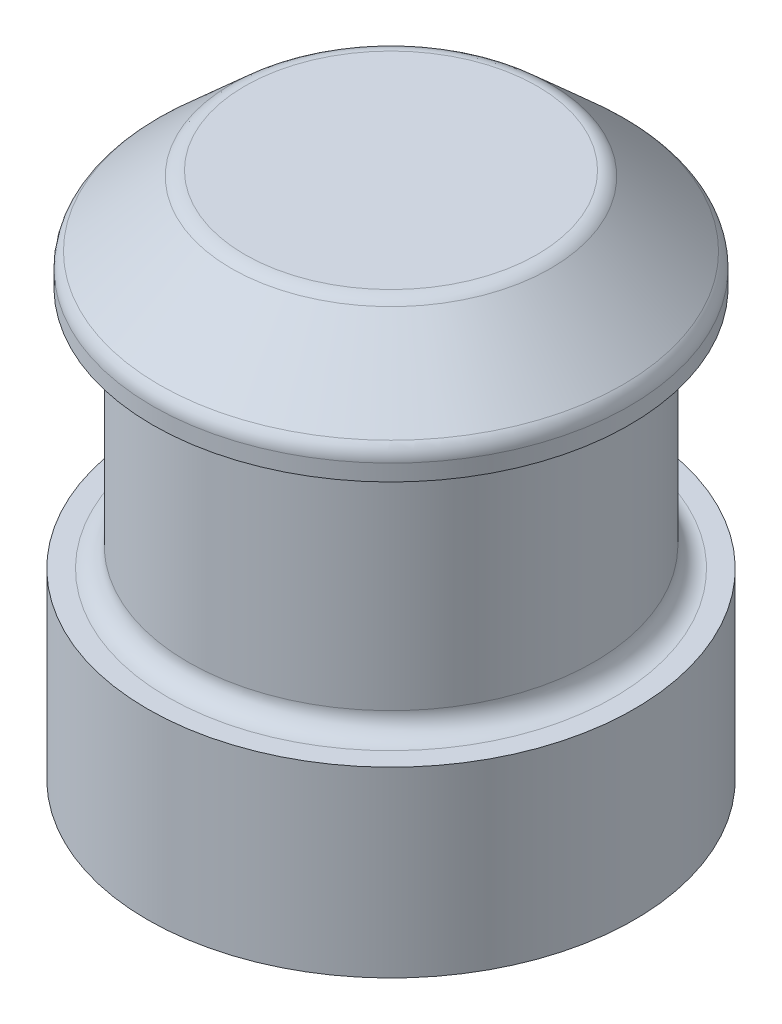
ISO-10303-21;
HEADER;
FILE_DESCRIPTION(('STEP AP214'),'2;1');
FILE_NAME('part.step','',(''),(''),'','','');
FILE_SCHEMA(('AUTOMOTIVE_DESIGN { 1 0 10303 214 1 1 1 1 }'));
ENDSEC;
DATA;
#1=APPLICATION_CONTEXT('core data for automotive mechanical design processes');
#2=APPLICATION_PROTOCOL_DEFINITION('international standard','automotive_design',2000,#1);
#3=PRODUCT_CONTEXT('',#1,'mechanical');
#4=PRODUCT('Part','Part','',(#3));
#5=PRODUCT_RELATED_PRODUCT_CATEGORY('part','',(#4));
#6=PRODUCT_DEFINITION_FORMATION('','',#4);
#7=PRODUCT_DEFINITION_CONTEXT('part definition',#1,'design');
#8=PRODUCT_DEFINITION('design','',#6,#7);
#9=PRODUCT_DEFINITION_SHAPE('','',#8);
#10=(LENGTH_UNIT() NAMED_UNIT(*) SI_UNIT(.MILLI.,.METRE.));
#11=(NAMED_UNIT(*) PLANE_ANGLE_UNIT() SI_UNIT($,.RADIAN.));
#12=(NAMED_UNIT(*) SI_UNIT($,.STERADIAN.) SOLID_ANGLE_UNIT());
#13=UNCERTAINTY_MEASURE_WITH_UNIT(LENGTH_MEASURE(1.E-05),#10,'distance_accuracy_value','');
#14=(GEOMETRIC_REPRESENTATION_CONTEXT(3) GLOBAL_UNCERTAINTY_ASSIGNED_CONTEXT((#13)) GLOBAL_UNIT_ASSIGNED_CONTEXT((#10,
#11,#12)) REPRESENTATION_CONTEXT('',''));
#15=CARTESIAN_POINT('',(0.,0.,0.));
#16=DIRECTION('',(0.,0.,1.));
#17=DIRECTION('',(1.,0.,0.));
#18=AXIS2_PLACEMENT_3D('',#15,#16,#17);
#19=CARTESIAN_POINT('',(0.,1.7125769521578,0.));
#20=DIRECTION('',(0.,-1.,0.));
#21=DIRECTION('',(0.,0.,-1.));
#22=AXIS2_PLACEMENT_3D('',#19,#20,#21);
#23=CYLINDRICAL_SURFACE('',#22,2.76);
#24=CARTESIAN_POINT('',(0.,1.7125769521578,0.));
#25=DIRECTION('',(0.,1.,0.));
#26=DIRECTION('',(0.,0.,1.));
#27=AXIS2_PLACEMENT_3D('',#24,#25,#26);
#28=CIRCLE('',#27,2.76);
#29=CARTESIAN_POINT('',(0.,1.7125769521578,2.76));
#30=VERTEX_POINT('',#29);
#31=EDGE_CURVE('E58',#30,#30,#28,.T.);
#32=ORIENTED_EDGE('',*,*,#31,.F.);
#33=EDGE_LOOP('',(#32));
#34=FACE_BOUND('',#33,.T.);
#35=CARTESIAN_POINT('',(0.,-0.357423047842197,0.));
#36=DIRECTION('',(0.,1.,0.));
#37=DIRECTION('',(0.,0.,1.));
#38=AXIS2_PLACEMENT_3D('',#35,#36,#37);
#39=CIRCLE('',#38,2.76);
#40=CARTESIAN_POINT('',(0.,-0.357423047842197,2.76));
#41=VERTEX_POINT('',#40);
#42=EDGE_CURVE('E59',#41,#41,#39,.T.);
#43=ORIENTED_EDGE('',*,*,#42,.T.);
#44=EDGE_LOOP('',(#43));
#45=FACE_BOUND('',#44,.T.);
#46=ADVANCED_FACE('F32',(#34,#45),#23,.T.);
#47=CARTESIAN_POINT('',(0.,1.7125769521578,0.));
#48=DIRECTION('',(0.,1.,0.));
#49=DIRECTION('',(0.,0.,1.));
#50=AXIS2_PLACEMENT_3D('',#47,#48,#49);
#51=PLANE('',#50);
#52=CARTESIAN_POINT('',(0.,1.7125769521578,0.));
#53=DIRECTION('',(0.,1.,0.));
#54=DIRECTION('',(0.,0.,1.));
#55=AXIS2_PLACEMENT_3D('',#52,#53,#54);
#56=CIRCLE('',#55,2.53);
#57=CARTESIAN_POINT('',(0.,1.7125769521578,2.53));
#58=VERTEX_POINT('',#57);
#59=EDGE_CURVE('E10',#58,#58,#56,.F.);
#60=ORIENTED_EDGE('',*,*,#59,.T.);
#61=EDGE_LOOP('',(#60));
#62=FACE_BOUND('',#61,.T.);
#63=ORIENTED_EDGE('',*,*,#31,.T.);
#64=EDGE_LOOP('',(#63));
#65=FACE_BOUND('',#64,.T.);
#66=ADVANCED_FACE('F90',(#62,#65),#51,.T.);
#67=CARTESIAN_POINT('',(0.,-0.357423047842197,0.));
#68=DIRECTION('',(0.,1.,0.));
#69=DIRECTION('',(0.,0.,1.));
#70=AXIS2_PLACEMENT_3D('',#67,#68,#69);
#71=PLANE('',#70);
#72=ORIENTED_EDGE('',*,*,#42,.F.);
#73=EDGE_LOOP('',(#72));
#74=FACE_BOUND('',#73,.T.);
#75=ADVANCED_FACE('F96',(#74),#71,.F.);
#76=CARTESIAN_POINT('',(0.,4.4725769521578,0.));
#77=DIRECTION('',(0.,-1.,0.));
#78=DIRECTION('',(0.,0.,-1.));
#79=AXIS2_PLACEMENT_3D('',#76,#77,#78);
#80=CYLINDRICAL_SURFACE('',#79,2.3);
#81=CARTESIAN_POINT('',(0.,1.9425769521578,0.));
#82=DIRECTION('',(0.,1.,0.));
#83=DIRECTION('',(0.,0.,1.));
#84=AXIS2_PLACEMENT_3D('',#81,#82,#83);
#85=CIRCLE('',#84,2.3);
#86=CARTESIAN_POINT('',(0.,1.9425769521578,2.3));
#87=VERTEX_POINT('',#86);
#88=EDGE_CURVE('E39',#87,#87,#85,.T.);
#89=ORIENTED_EDGE('',*,*,#88,.T.);
#90=EDGE_LOOP('',(#89));
#91=FACE_BOUND('',#90,.T.);
#92=CARTESIAN_POINT('',(0.,4.4725769521578,0.));
#93=DIRECTION('',(0.,1.,0.));
#94=DIRECTION('',(0.,0.,1.));
#95=AXIS2_PLACEMENT_3D('',#92,#93,#94);
#96=CIRCLE('',#95,2.3);
#97=CARTESIAN_POINT('',(0.,4.4725769521578,2.3));
#98=VERTEX_POINT('',#97);
#99=EDGE_CURVE('E62',#98,#98,#96,.T.);
#100=ORIENTED_EDGE('',*,*,#99,.F.);
#101=EDGE_LOOP('',(#100));
#102=FACE_BOUND('',#101,.T.);
#103=ADVANCED_FACE('F116',(#91,#102),#80,.T.);
#104=CARTESIAN_POINT('',(0.,5.6225769521578,0.));
#105=DIRECTION('',(0.,-1.,0.));
#106=DIRECTION('',(0.,0.,-1.));
#107=AXIS2_PLACEMENT_3D('',#104,#105,#106);
#108=CYLINDRICAL_SURFACE('',#107,2.7025);
#109=CARTESIAN_POINT('',(0.,4.65767435453684,0.));
#110=DIRECTION('',(0.,1.,0.));
#111=DIRECTION('',(0.,0.,1.));
#112=AXIS2_PLACEMENT_3D('',#109,#110,#111);
#113=CIRCLE('',#112,2.7025);
#114=CARTESIAN_POINT('',(0.,4.65767435453684,2.7025));
#115=VERTEX_POINT('',#114);
#116=EDGE_CURVE('E43',#115,#115,#113,.F.);
#117=ORIENTED_EDGE('',*,*,#116,.T.);
#118=EDGE_LOOP('',(#117));
#119=FACE_BOUND('',#118,.T.);
#120=CARTESIAN_POINT('',(0.,4.4725769521578,0.));
#121=DIRECTION('',(0.,1.,0.));
#122=DIRECTION('',(0.,0.,1.));
#123=AXIS2_PLACEMENT_3D('',#120,#121,#122);
#124=CIRCLE('',#123,2.7025);
#125=CARTESIAN_POINT('',(0.,4.4725769521578,2.7025));
#126=VERTEX_POINT('',#125);
#127=EDGE_CURVE('E67',#126,#126,#124,.T.);
#128=ORIENTED_EDGE('',*,*,#127,.T.);
#129=EDGE_LOOP('',(#128));
#130=FACE_BOUND('',#129,.T.);
#131=ADVANCED_FACE('F71',(#119,#130),#108,.T.);
#132=CARTESIAN_POINT('',(0.,5.6225769521578,0.));
#133=DIRECTION('',(0.,1.,0.));
#134=DIRECTION('',(0.,0.,1.));
#135=AXIS2_PLACEMENT_3D('',#132,#133,#134);
#136=PLANE('',#135);
#137=CARTESIAN_POINT('',(0.,5.6225769521578,0.));
#138=DIRECTION('',(0.,1.,0.));
#139=DIRECTION('',(0.,0.,1.));
#140=AXIS2_PLACEMENT_3D('',#137,#138,#139);
#141=CIRCLE('',#140,1.65630797790168);
#142=CARTESIAN_POINT('',(0.,5.6225769521578,1.65630797790168));
#143=VERTEX_POINT('',#142);
#144=EDGE_CURVE('E55',#143,#143,#141,.T.);
#145=ORIENTED_EDGE('',*,*,#144,.T.);
#146=EDGE_LOOP('',(#145));
#147=FACE_BOUND('',#146,.T.);
#148=ADVANCED_FACE('F76',(#147),#136,.T.);
#149=CARTESIAN_POINT('',(0.,4.4725769521578,0.));
#150=DIRECTION('',(0.,1.,0.));
#151=DIRECTION('',(0.,0.,1.));
#152=AXIS2_PLACEMENT_3D('',#149,#150,#151);
#153=PLANE('',#152);
#154=ORIENTED_EDGE('',*,*,#99,.T.);
#155=EDGE_LOOP('',(#154));
#156=FACE_BOUND('',#155,.T.);
#157=ORIENTED_EDGE('',*,*,#127,.F.);
#158=EDGE_LOOP('',(#157));
#159=FACE_BOUND('',#158,.T.);
#160=ADVANCED_FACE('F73',(#156,#159),#153,.F.);
#161=CARTESIAN_POINT('',(0.,5.6225769521578,0.));
#162=DIRECTION('',(0.,-1.,0.));
#163=DIRECTION('',(0.,0.,-1.));
#164=AXIS2_PLACEMENT_3D('',#161,#162,#163);
#165=CONICAL_SURFACE('',#164,1.74459670595982,0.837758040957275);
#166=CARTESIAN_POINT('',(0.,5.5635002620176,0.));
#167=DIRECTION('',(0.,1.,0.));
#168=DIRECTION('',(0.,0.,1.));
#169=AXIS2_PLACEMENT_3D('',#166,#167,#168);
#170=CIRCLE('',#169,1.81020801736421);
#171=CARTESIAN_POINT('',(0.,5.5635002620176,1.81020801736421));
#172=VERTEX_POINT('',#171);
#173=EDGE_CURVE('E47',#172,#172,#170,.F.);
#174=ORIENTED_EDGE('',*,*,#173,.T.);
#175=EDGE_LOOP('',(#174));
#176=FACE_BOUND('',#175,.T.);
#177=CARTESIAN_POINT('',(0.,4.82859766439664,0.));
#178=DIRECTION('',(0.,-1.,0.));
#179=DIRECTION('',(0.,0.,-1.));
#180=AXIS2_PLACEMENT_3D('',#177,#178,#179);
#181=CIRCLE('',#180,2.62640003946254);
#182=CARTESIAN_POINT('',(0.,4.82859766439664,-2.62640003946254));
#183=VERTEX_POINT('',#182);
#184=EDGE_CURVE('E52',#183,#183,#181,.F.);
#185=ORIENTED_EDGE('',*,*,#184,.T.);
#186=EDGE_LOOP('',(#185));
#187=FACE_BOUND('',#186,.T.);
#188=ADVANCED_FACE('F75',(#176,#187),#165,.T.);
#189=CARTESIAN_POINT('',(0.,5.3925769521578,0.));
#190=DIRECTION('',(0.,1.,0.));
#191=DIRECTION('',(0.,0.,1.));
#192=AXIS2_PLACEMENT_3D('',#189,#190,#191);
#193=TOROIDAL_SURFACE('',#192,1.65630797790168,0.23);
#194=ORIENTED_EDGE('',*,*,#173,.F.);
#195=EDGE_LOOP('',(#194));
#196=FACE_BOUND('',#195,.T.);
#197=ORIENTED_EDGE('',*,*,#144,.F.);
#198=EDGE_LOOP('',(#197));
#199=FACE_BOUND('',#198,.T.);
#200=ADVANCED_FACE('F83',(#196,#199),#193,.T.);
#201=CARTESIAN_POINT('',(0.,4.65767435453684,0.));
#202=DIRECTION('',(0.,1.,0.));
#203=DIRECTION('',(0.,0.,1.));
#204=AXIS2_PLACEMENT_3D('',#201,#202,#203);
#205=TOROIDAL_SURFACE('',#204,2.4725,0.23);
#206=ORIENTED_EDGE('',*,*,#184,.F.);
#207=EDGE_LOOP('',(#206));
#208=FACE_BOUND('',#207,.T.);
#209=ORIENTED_EDGE('',*,*,#116,.F.);
#210=EDGE_LOOP('',(#209));
#211=FACE_BOUND('',#210,.T.);
#212=ADVANCED_FACE('F103',(#208,#211),#205,.T.);
#213=CARTESIAN_POINT('',(0.,1.9425769521578,0.));
#214=DIRECTION('',(0.,1.,0.));
#215=DIRECTION('',(0.,0.,1.));
#216=AXIS2_PLACEMENT_3D('',#213,#214,#215);
#217=TOROIDAL_SURFACE('',#216,2.53,0.23);
#218=ORIENTED_EDGE('',*,*,#59,.F.);
#219=EDGE_LOOP('',(#218));
#220=FACE_BOUND('',#219,.T.);
#221=ORIENTED_EDGE('',*,*,#88,.F.);
#222=EDGE_LOOP('',(#221));
#223=FACE_BOUND('',#222,.T.);
#224=ADVANCED_FACE('F34',(#220,#223),#217,.F.);
#225=CLOSED_SHELL('',(#46,#66,#75,#103,#131,#148,#160,#188,#200,#212,#224));
#226=MANIFOLD_SOLID_BREP('B2',#225);
#227=ADVANCED_BREP_SHAPE_REPRESENTATION('',(#18,#226),#14);
#228=SHAPE_DEFINITION_REPRESENTATION(#9,#227);
ENDSEC;
END-ISO-10303-21;
